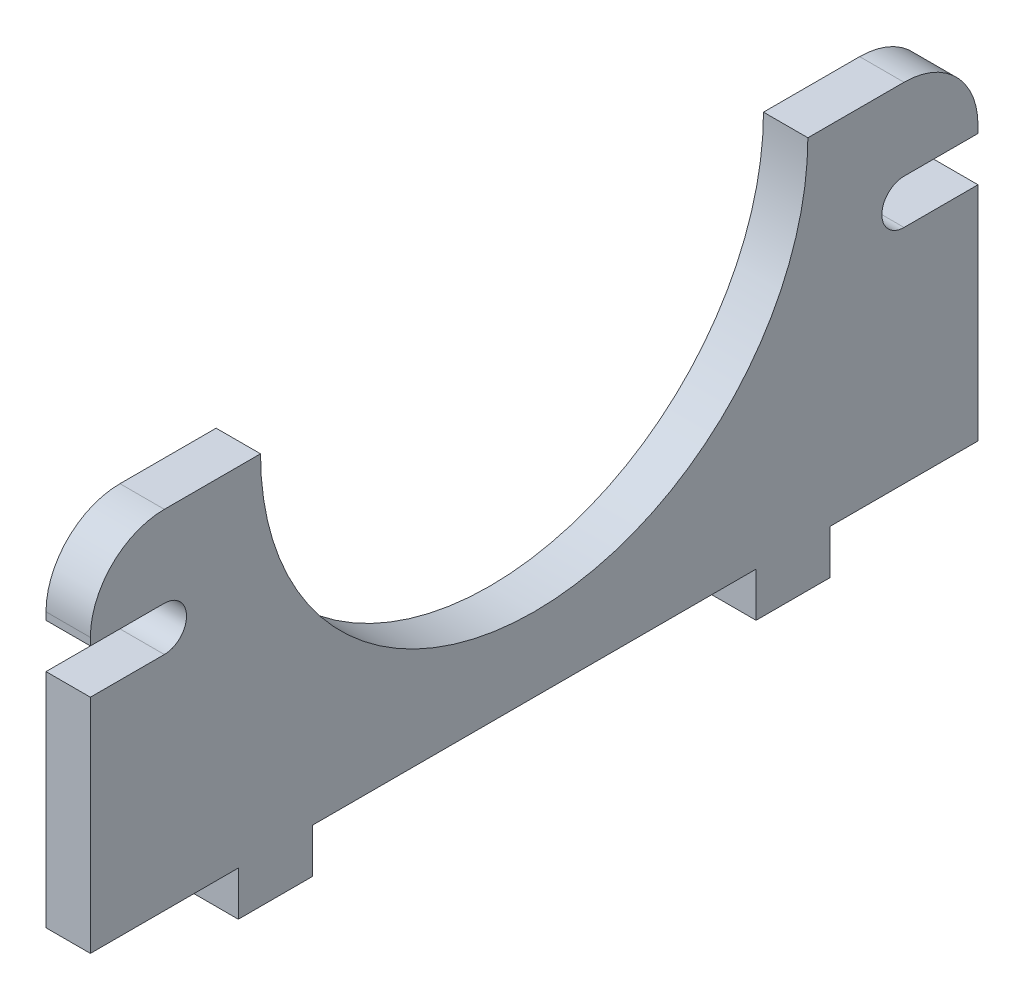
ISO-10303-21;
HEADER;
FILE_DESCRIPTION(('STEP AP214'),'2;1');
FILE_NAME('part.step','',(''),(''),'','','');
FILE_SCHEMA(('AUTOMOTIVE_DESIGN { 1 0 10303 214 1 1 1 1 }'));
ENDSEC;
DATA;
#1=APPLICATION_CONTEXT('core data for automotive mechanical design processes');
#2=APPLICATION_PROTOCOL_DEFINITION('international standard','automotive_design',2000,#1);
#3=PRODUCT_CONTEXT('',#1,'mechanical');
#4=PRODUCT('Part','Part','',(#3));
#5=PRODUCT_RELATED_PRODUCT_CATEGORY('part','',(#4));
#6=PRODUCT_DEFINITION_FORMATION('','',#4);
#7=PRODUCT_DEFINITION_CONTEXT('part definition',#1,'design');
#8=PRODUCT_DEFINITION('design','',#6,#7);
#9=PRODUCT_DEFINITION_SHAPE('','',#8);
#10=(LENGTH_UNIT() NAMED_UNIT(*) SI_UNIT(.MILLI.,.METRE.));
#11=(NAMED_UNIT(*) PLANE_ANGLE_UNIT() SI_UNIT($,.RADIAN.));
#12=(NAMED_UNIT(*) SI_UNIT($,.STERADIAN.) SOLID_ANGLE_UNIT());
#13=UNCERTAINTY_MEASURE_WITH_UNIT(LENGTH_MEASURE(1.E-05),#10,'distance_accuracy_value','');
#14=(GEOMETRIC_REPRESENTATION_CONTEXT(3) GLOBAL_UNCERTAINTY_ASSIGNED_CONTEXT((#13)) GLOBAL_UNIT_ASSIGNED_CONTEXT((#10,
#11,#12)) REPRESENTATION_CONTEXT('',''));
#15=CARTESIAN_POINT('',(0.,0.,0.));
#16=DIRECTION('',(0.,0.,1.));
#17=DIRECTION('',(1.,0.,0.));
#18=AXIS2_PLACEMENT_3D('',#15,#16,#17);
#19=CARTESIAN_POINT('',(3.,-11.75,-30.));
#20=DIRECTION('',(0.,1.,0.));
#21=DIRECTION('',(0.,0.,1.));
#22=AXIS2_PLACEMENT_3D('',#19,#20,#21);
#23=PLANE('',#22);
#24=DIRECTION('',(0.,0.,-1.));
#25=VECTOR('',#24,1.);
#26=CARTESIAN_POINT('',(3.,-11.75,-30.));
#27=LINE('',#26,#25);
#28=CARTESIAN_POINT('',(3.,-11.75,15.));
#29=VERTEX_POINT('',#28);
#30=CARTESIAN_POINT('',(3.,-11.75,-15.));
#31=VERTEX_POINT('',#30);
#32=EDGE_CURVE('E54',#29,#31,#27,.T.);
#33=ORIENTED_EDGE('',*,*,#32,.F.);
#34=DIRECTION('',(-1.,0.,0.));
#35=VECTOR('',#34,1.);
#36=CARTESIAN_POINT('',(0.,-11.75,15.));
#37=LINE('',#36,#35);
#38=CARTESIAN_POINT('',(0.,-11.75,15.));
#39=VERTEX_POINT('',#38);
#40=EDGE_CURVE('E232',#29,#39,#37,.T.);
#41=ORIENTED_EDGE('',*,*,#40,.T.);
#42=DIRECTION('',(0.,0.,-1.));
#43=VECTOR('',#42,1.);
#44=CARTESIAN_POINT('',(0.,-11.75,-30.));
#45=LINE('',#44,#43);
#46=CARTESIAN_POINT('',(0.,-11.75,-15.));
#47=VERTEX_POINT('',#46);
#48=EDGE_CURVE('E209',#39,#47,#45,.T.);
#49=ORIENTED_EDGE('',*,*,#48,.T.);
#50=DIRECTION('',(-1.,0.,0.));
#51=VECTOR('',#50,1.);
#52=CARTESIAN_POINT('',(0.,-11.75,-15.));
#53=LINE('',#52,#51);
#54=EDGE_CURVE('E244',#31,#47,#53,.T.);
#55=ORIENTED_EDGE('',*,*,#54,.F.);
#56=EDGE_LOOP('',(#33,#41,#49,#55));
#57=FACE_BOUND('',#56,.T.);
#58=ADVANCED_FACE('F39',(#57),#23,.F.);
#59=CARTESIAN_POINT('',(0.,-11.75,30.));
#60=VERTEX_POINT('',#59);
#61=CARTESIAN_POINT('',(0.,-11.75,20.));
#62=VERTEX_POINT('',#61);
#63=EDGE_CURVE('E339',#60,#62,#45,.T.);
#64=ORIENTED_EDGE('',*,*,#63,.T.);
#65=DIRECTION('',(1.,0.,0.));
#66=VECTOR('',#65,1.);
#67=CARTESIAN_POINT('',(0.,-11.75,20.));
#68=LINE('',#67,#66);
#69=CARTESIAN_POINT('',(3.,-11.75,20.));
#70=VERTEX_POINT('',#69);
#71=EDGE_CURVE('E62',#62,#70,#68,.T.);
#72=ORIENTED_EDGE('',*,*,#71,.T.);
#73=CARTESIAN_POINT('',(3.,-11.75,30.));
#74=VERTEX_POINT('',#73);
#75=EDGE_CURVE('E322',#74,#70,#27,.T.);
#76=ORIENTED_EDGE('',*,*,#75,.F.);
#77=DIRECTION('',(-1.,0.,0.));
#78=VECTOR('',#77,1.);
#79=CARTESIAN_POINT('',(3.,-11.75,30.));
#80=LINE('',#79,#78);
#81=EDGE_CURVE('E360',#74,#60,#80,.T.);
#82=ORIENTED_EDGE('',*,*,#81,.T.);
#83=EDGE_LOOP('',(#64,#72,#76,#82));
#84=FACE_BOUND('',#83,.T.);
#85=ADVANCED_FACE('F424',(#84),#23,.F.);
#86=DIRECTION('',(1.,0.,0.));
#87=VECTOR('',#86,1.);
#88=CARTESIAN_POINT('',(0.,-11.75,-20.));
#89=LINE('',#88,#87);
#90=CARTESIAN_POINT('',(0.,-11.75,-20.));
#91=VERTEX_POINT('',#90);
#92=CARTESIAN_POINT('',(3.,-11.75,-20.));
#93=VERTEX_POINT('',#92);
#94=EDGE_CURVE('E213',#91,#93,#89,.T.);
#95=ORIENTED_EDGE('',*,*,#94,.F.);
#96=CARTESIAN_POINT('',(0.,-11.75,-30.));
#97=VERTEX_POINT('',#96);
#98=EDGE_CURVE('E338',#91,#97,#45,.T.);
#99=ORIENTED_EDGE('',*,*,#98,.T.);
#100=DIRECTION('',(-1.,0.,0.));
#101=VECTOR('',#100,1.);
#102=CARTESIAN_POINT('',(3.,-11.75,-30.));
#103=LINE('',#102,#101);
#104=CARTESIAN_POINT('',(3.,-11.75,-30.));
#105=VERTEX_POINT('',#104);
#106=EDGE_CURVE('E357',#105,#97,#103,.T.);
#107=ORIENTED_EDGE('',*,*,#106,.F.);
#108=EDGE_CURVE('E320',#93,#105,#27,.T.);
#109=ORIENTED_EDGE('',*,*,#108,.F.);
#110=EDGE_LOOP('',(#95,#99,#107,#109));
#111=FACE_BOUND('',#110,.T.);
#112=ADVANCED_FACE('F438',(#111),#23,.F.);
#113=CARTESIAN_POINT('',(3.,-11.75,-30.));
#114=DIRECTION('',(0.,0.,1.));
#115=DIRECTION('',(1.,0.,0.));
#116=AXIS2_PLACEMENT_3D('',#113,#114,#115);
#117=PLANE('',#116);
#118=DIRECTION('',(0.,1.,0.));
#119=VECTOR('',#118,1.);
#120=CARTESIAN_POINT('',(0.,-11.75,-30.));
#121=LINE('',#120,#119);
#122=CARTESIAN_POINT('',(0.,6.25,-30.));
#123=VERTEX_POINT('',#122);
#124=CARTESIAN_POINT('',(0.,6.75,-30.));
#125=VERTEX_POINT('',#124);
#126=EDGE_CURVE('E341',#123,#125,#121,.T.);
#127=ORIENTED_EDGE('',*,*,#126,.T.);
#128=DIRECTION('',(-1.,0.,0.));
#129=VECTOR('',#128,1.);
#130=CARTESIAN_POINT('',(3.,6.75,-30.));
#131=LINE('',#130,#129);
#132=CARTESIAN_POINT('',(3.,6.75,-30.));
#133=VERTEX_POINT('',#132);
#134=EDGE_CURVE('E11',#125,#133,#131,.F.);
#135=ORIENTED_EDGE('',*,*,#134,.T.);
#136=DIRECTION('',(0.,1.,0.));
#137=VECTOR('',#136,1.);
#138=CARTESIAN_POINT('',(3.,-11.75,-30.));
#139=LINE('',#138,#137);
#140=CARTESIAN_POINT('',(3.,6.25,-30.));
#141=VERTEX_POINT('',#140);
#142=EDGE_CURVE('E324',#141,#133,#139,.T.);
#143=ORIENTED_EDGE('',*,*,#142,.F.);
#144=DIRECTION('',(1.,0.,0.));
#145=VECTOR('',#144,1.);
#146=CARTESIAN_POINT('',(0.,6.25,-30.));
#147=LINE('',#146,#145);
#148=EDGE_CURVE('E285',#123,#141,#147,.T.);
#149=ORIENTED_EDGE('',*,*,#148,.F.);
#150=EDGE_LOOP('',(#127,#135,#143,#149));
#151=FACE_BOUND('',#150,.T.);
#152=ADVANCED_FACE('F445',(#151),#117,.F.);
#153=DIRECTION('',(1.,0.,0.));
#154=VECTOR('',#153,1.);
#155=CARTESIAN_POINT('',(0.,3.25,-30.));
#156=LINE('',#155,#154);
#157=CARTESIAN_POINT('',(0.,3.25,-30.));
#158=VERTEX_POINT('',#157);
#159=CARTESIAN_POINT('',(3.,3.25,-30.));
#160=VERTEX_POINT('',#159);
#161=EDGE_CURVE('E287',#158,#160,#156,.T.);
#162=ORIENTED_EDGE('',*,*,#161,.T.);
#163=EDGE_CURVE('E325',#105,#160,#139,.T.);
#164=ORIENTED_EDGE('',*,*,#163,.F.);
#165=ORIENTED_EDGE('',*,*,#106,.T.);
#166=EDGE_CURVE('E342',#97,#158,#121,.T.);
#167=ORIENTED_EDGE('',*,*,#166,.T.);
#168=EDGE_LOOP('',(#162,#164,#165,#167));
#169=FACE_BOUND('',#168,.T.);
#170=ADVANCED_FACE('F450',(#169),#117,.F.);
#171=CARTESIAN_POINT('',(3.,11.75,0.));
#172=DIRECTION('',(1.,0.,0.));
#173=DIRECTION('',(0.,0.,-1.));
#174=AXIS2_PLACEMENT_3D('',#171,#172,#173);
#175=PLANE('',#174);
#176=DIRECTION('',(0.,0.,1.));
#177=VECTOR('',#176,1.);
#178=CARTESIAN_POINT('',(3.,11.75,18.5));
#179=LINE('',#178,#177);
#180=CARTESIAN_POINT('',(3.,11.75,18.5));
#181=VERTEX_POINT('',#180);
#182=CARTESIAN_POINT('',(3.,11.75,25.));
#183=VERTEX_POINT('',#182);
#184=EDGE_CURVE('E332',#181,#183,#179,.T.);
#185=ORIENTED_EDGE('',*,*,#184,.T.);
#186=CARTESIAN_POINT('',(3.,6.75,25.));
#187=DIRECTION('',(1.,0.,0.));
#188=DIRECTION('',(0.,0.,-1.));
#189=AXIS2_PLACEMENT_3D('',#186,#187,#188);
#190=CIRCLE('',#189,5.);
#191=CARTESIAN_POINT('',(3.,6.75,30.));
#192=VERTEX_POINT('',#191);
#193=EDGE_CURVE('E374',#183,#192,#190,.T.);
#194=ORIENTED_EDGE('',*,*,#193,.T.);
#195=DIRECTION('',(0.,-1.,0.));
#196=VECTOR('',#195,1.);
#197=CARTESIAN_POINT('',(3.,-11.75,30.));
#198=LINE('',#197,#196);
#199=CARTESIAN_POINT('',(3.,6.25,30.));
#200=VERTEX_POINT('',#199);
#201=EDGE_CURVE('E318',#192,#200,#198,.T.);
#202=ORIENTED_EDGE('',*,*,#201,.T.);
#203=DIRECTION('',(0.,0.,1.));
#204=VECTOR('',#203,1.);
#205=CARTESIAN_POINT('',(3.,6.25,25.));
#206=LINE('',#205,#204);
#207=CARTESIAN_POINT('',(3.,6.25,25.));
#208=VERTEX_POINT('',#207);
#209=EDGE_CURVE('E304',#208,#200,#206,.T.);
#210=ORIENTED_EDGE('',*,*,#209,.F.);
#211=CARTESIAN_POINT('',(3.,4.75,25.));
#212=DIRECTION('',(1.,0.,0.));
#213=DIRECTION('',(0.,0.,-1.));
#214=AXIS2_PLACEMENT_3D('',#211,#212,#213);
#215=CIRCLE('',#214,1.5);
#216=CARTESIAN_POINT('',(3.,3.25,25.));
#217=VERTEX_POINT('',#216);
#218=EDGE_CURVE('E284',#217,#208,#215,.T.);
#219=ORIENTED_EDGE('',*,*,#218,.F.);
#220=DIRECTION('',(0.,0.,-1.));
#221=VECTOR('',#220,1.);
#222=CARTESIAN_POINT('',(3.,3.25,25.));
#223=LINE('',#222,#221);
#224=CARTESIAN_POINT('',(3.,3.25,30.));
#225=VERTEX_POINT('',#224);
#226=EDGE_CURVE('E295',#225,#217,#223,.T.);
#227=ORIENTED_EDGE('',*,*,#226,.F.);
#228=EDGE_CURVE('E321',#225,#74,#198,.T.);
#229=ORIENTED_EDGE('',*,*,#228,.T.);
#230=ORIENTED_EDGE('',*,*,#75,.T.);
#231=DIRECTION('',(0.,1.,0.));
#232=VECTOR('',#231,1.);
#233=CARTESIAN_POINT('',(3.,-14.75,20.));
#234=LINE('',#233,#232);
#235=CARTESIAN_POINT('',(3.,-14.75,20.));
#236=VERTEX_POINT('',#235);
#237=EDGE_CURVE('E236',#236,#70,#234,.T.);
#238=ORIENTED_EDGE('',*,*,#237,.F.);
#239=DIRECTION('',(0.,0.,-1.));
#240=VECTOR('',#239,1.);
#241=CARTESIAN_POINT('',(3.,-14.75,20.));
#242=LINE('',#241,#240);
#243=CARTESIAN_POINT('',(3.,-14.75,15.));
#244=VERTEX_POINT('',#243);
#245=EDGE_CURVE('E226',#236,#244,#242,.T.);
#246=ORIENTED_EDGE('',*,*,#245,.T.);
#247=DIRECTION('',(0.,1.,0.));
#248=VECTOR('',#247,1.);
#249=CARTESIAN_POINT('',(3.,-14.75,15.));
#250=LINE('',#249,#248);
#251=EDGE_CURVE('E214',#244,#29,#250,.T.);
#252=ORIENTED_EDGE('',*,*,#251,.T.);
#253=ORIENTED_EDGE('',*,*,#32,.T.);
#254=DIRECTION('',(0.,1.,0.));
#255=VECTOR('',#254,1.);
#256=CARTESIAN_POINT('',(3.,-14.75,-15.));
#257=LINE('',#256,#255);
#258=CARTESIAN_POINT('',(3.,-14.75,-15.));
#259=VERTEX_POINT('',#258);
#260=EDGE_CURVE('E256',#259,#31,#257,.T.);
#261=ORIENTED_EDGE('',*,*,#260,.F.);
#262=DIRECTION('',(0.,0.,1.));
#263=VECTOR('',#262,1.);
#264=CARTESIAN_POINT('',(3.,-14.75,-20.));
#265=LINE('',#264,#263);
#266=CARTESIAN_POINT('',(3.,-14.75,-20.));
#267=VERTEX_POINT('',#266);
#268=EDGE_CURVE('E246',#267,#259,#265,.T.);
#269=ORIENTED_EDGE('',*,*,#268,.F.);
#270=DIRECTION('',(0.,1.,0.));
#271=VECTOR('',#270,1.);
#272=CARTESIAN_POINT('',(3.,-14.75,-20.));
#273=LINE('',#272,#271);
#274=EDGE_CURVE('E259',#267,#93,#273,.T.);
#275=ORIENTED_EDGE('',*,*,#274,.T.);
#276=ORIENTED_EDGE('',*,*,#108,.T.);
#277=ORIENTED_EDGE('',*,*,#163,.T.);
#278=DIRECTION('',(0.,0.,1.));
#279=VECTOR('',#278,1.);
#280=CARTESIAN_POINT('',(3.,3.25,-25.));
#281=LINE('',#280,#279);
#282=CARTESIAN_POINT('',(3.,3.25,-25.));
#283=VERTEX_POINT('',#282);
#284=EDGE_CURVE('E276',#160,#283,#281,.T.);
#285=ORIENTED_EDGE('',*,*,#284,.T.);
#286=CARTESIAN_POINT('',(3.,4.75,-25.));
#287=DIRECTION('',(-1.,0.,0.));
#288=DIRECTION('',(0.,0.,1.));
#289=AXIS2_PLACEMENT_3D('',#286,#287,#288);
#290=CIRCLE('',#289,1.5);
#291=CARTESIAN_POINT('',(3.,6.25,-25.));
#292=VERTEX_POINT('',#291);
#293=EDGE_CURVE('E265',#283,#292,#290,.T.);
#294=ORIENTED_EDGE('',*,*,#293,.T.);
#295=DIRECTION('',(0.,0.,-1.));
#296=VECTOR('',#295,1.);
#297=CARTESIAN_POINT('',(3.,6.25,-25.));
#298=LINE('',#297,#296);
#299=EDGE_CURVE('E269',#292,#141,#298,.T.);
#300=ORIENTED_EDGE('',*,*,#299,.T.);
#301=ORIENTED_EDGE('',*,*,#142,.T.);
#302=CARTESIAN_POINT('',(3.,6.75,-25.));
#303=DIRECTION('',(1.,0.,0.));
#304=DIRECTION('',(0.,0.,-1.));
#305=AXIS2_PLACEMENT_3D('',#302,#303,#304);
#306=CIRCLE('',#305,5.);
#307=CARTESIAN_POINT('',(3.,11.75,-25.));
#308=VERTEX_POINT('',#307);
#309=EDGE_CURVE('E372',#133,#308,#306,.T.);
#310=ORIENTED_EDGE('',*,*,#309,.T.);
#311=DIRECTION('',(0.,0.,1.));
#312=VECTOR('',#311,1.);
#313=CARTESIAN_POINT('',(3.,11.75,-30.));
#314=LINE('',#313,#312);
#315=CARTESIAN_POINT('',(3.,11.75,-18.5));
#316=VERTEX_POINT('',#315);
#317=EDGE_CURVE('E328',#308,#316,#314,.T.);
#318=ORIENTED_EDGE('',*,*,#317,.T.);
#319=CARTESIAN_POINT('',(3.,11.75,0.));
#320=DIRECTION('',(-1.,0.,0.));
#321=DIRECTION('',(0.,0.,-1.));
#322=AXIS2_PLACEMENT_3D('',#319,#320,#321);
#323=CIRCLE('',#322,18.5);
#324=EDGE_CURVE('E330',#316,#181,#323,.T.);
#325=ORIENTED_EDGE('',*,*,#324,.T.);
#326=EDGE_LOOP('',(#185,#194,#202,#210,#219,#227,#229,#230,#238,#246,#252,#253,#261,#269,#275,
#276,#277,#285,#294,#300,#301,#310,#318,#325));
#327=FACE_BOUND('',#326,.T.);
#328=ADVANCED_FACE('F398',(#327),#175,.T.);
#329=CARTESIAN_POINT('',(0.,11.75,0.));
#330=DIRECTION('',(1.,0.,0.));
#331=DIRECTION('',(0.,0.,-1.));
#332=AXIS2_PLACEMENT_3D('',#329,#330,#331);
#333=PLANE('',#332);
#334=DIRECTION('',(0.,-1.,0.));
#335=VECTOR('',#334,1.);
#336=CARTESIAN_POINT('',(0.,-11.75,30.));
#337=LINE('',#336,#335);
#338=CARTESIAN_POINT('',(0.,6.75,30.));
#339=VERTEX_POINT('',#338);
#340=CARTESIAN_POINT('',(0.,6.25,30.));
#341=VERTEX_POINT('',#340);
#342=EDGE_CURVE('E336',#339,#341,#337,.T.);
#343=ORIENTED_EDGE('',*,*,#342,.F.);
#344=CARTESIAN_POINT('',(0.,6.75,25.));
#345=DIRECTION('',(1.,0.,0.));
#346=DIRECTION('',(0.,0.,-1.));
#347=AXIS2_PLACEMENT_3D('',#344,#345,#346);
#348=CIRCLE('',#347,5.);
#349=CARTESIAN_POINT('',(0.,11.75,25.));
#350=VERTEX_POINT('',#349);
#351=EDGE_CURVE('E368',#339,#350,#348,.F.);
#352=ORIENTED_EDGE('',*,*,#351,.T.);
#353=DIRECTION('',(0.,0.,1.));
#354=VECTOR('',#353,1.);
#355=CARTESIAN_POINT('',(0.,11.75,18.5));
#356=LINE('',#355,#354);
#357=CARTESIAN_POINT('',(0.,11.75,18.5));
#358=VERTEX_POINT('',#357);
#359=EDGE_CURVE('E349',#358,#350,#356,.T.);
#360=ORIENTED_EDGE('',*,*,#359,.F.);
#361=CARTESIAN_POINT('',(0.,11.75,0.));
#362=DIRECTION('',(-1.,0.,0.));
#363=DIRECTION('',(0.,0.,-1.));
#364=AXIS2_PLACEMENT_3D('',#361,#362,#363);
#365=CIRCLE('',#364,18.5);
#366=CARTESIAN_POINT('',(0.,11.75,-18.5));
#367=VERTEX_POINT('',#366);
#368=EDGE_CURVE('E347',#367,#358,#365,.T.);
#369=ORIENTED_EDGE('',*,*,#368,.F.);
#370=DIRECTION('',(0.,0.,1.));
#371=VECTOR('',#370,1.);
#372=CARTESIAN_POINT('',(0.,11.75,-30.));
#373=LINE('',#372,#371);
#374=CARTESIAN_POINT('',(0.,11.75,-25.));
#375=VERTEX_POINT('',#374);
#376=EDGE_CURVE('E345',#375,#367,#373,.T.);
#377=ORIENTED_EDGE('',*,*,#376,.F.);
#378=CARTESIAN_POINT('',(0.,6.75,-25.));
#379=DIRECTION('',(1.,0.,0.));
#380=DIRECTION('',(0.,0.,-1.));
#381=AXIS2_PLACEMENT_3D('',#378,#379,#380);
#382=CIRCLE('',#381,5.);
#383=EDGE_CURVE('E366',#375,#125,#382,.F.);
#384=ORIENTED_EDGE('',*,*,#383,.T.);
#385=ORIENTED_EDGE('',*,*,#126,.F.);
#386=DIRECTION('',(0.,0.,-1.));
#387=VECTOR('',#386,1.);
#388=CARTESIAN_POINT('',(0.,6.25,-25.));
#389=LINE('',#388,#387);
#390=CARTESIAN_POINT('',(0.,6.25,-25.));
#391=VERTEX_POINT('',#390);
#392=EDGE_CURVE('E271',#391,#123,#389,.T.);
#393=ORIENTED_EDGE('',*,*,#392,.F.);
#394=CARTESIAN_POINT('',(0.,4.75,-25.));
#395=DIRECTION('',(-1.,0.,0.));
#396=DIRECTION('',(0.,0.,1.));
#397=AXIS2_PLACEMENT_3D('',#394,#395,#396);
#398=CIRCLE('',#397,1.5);
#399=CARTESIAN_POINT('',(0.,3.25,-25.));
#400=VERTEX_POINT('',#399);
#401=EDGE_CURVE('E266',#400,#391,#398,.T.);
#402=ORIENTED_EDGE('',*,*,#401,.F.);
#403=DIRECTION('',(0.,0.,1.));
#404=VECTOR('',#403,1.);
#405=CARTESIAN_POINT('',(0.,3.25,-25.));
#406=LINE('',#405,#404);
#407=EDGE_CURVE('E268',#158,#400,#406,.T.);
#408=ORIENTED_EDGE('',*,*,#407,.F.);
#409=ORIENTED_EDGE('',*,*,#166,.F.);
#410=ORIENTED_EDGE('',*,*,#98,.F.);
#411=DIRECTION('',(0.,1.,0.));
#412=VECTOR('',#411,1.);
#413=CARTESIAN_POINT('',(0.,-14.75,-20.));
#414=LINE('',#413,#412);
#415=CARTESIAN_POINT('',(0.,-14.75,-20.));
#416=VERTEX_POINT('',#415);
#417=EDGE_CURVE('E262',#416,#91,#414,.T.);
#418=ORIENTED_EDGE('',*,*,#417,.F.);
#419=DIRECTION('',(0.,0.,-1.));
#420=VECTOR('',#419,1.);
#421=CARTESIAN_POINT('',(0.,-14.75,-20.));
#422=LINE('',#421,#420);
#423=CARTESIAN_POINT('',(0.,-14.75,-15.));
#424=VERTEX_POINT('',#423);
#425=EDGE_CURVE('E240',#424,#416,#422,.T.);
#426=ORIENTED_EDGE('',*,*,#425,.F.);
#427=DIRECTION('',(0.,1.,0.));
#428=VECTOR('',#427,1.);
#429=CARTESIAN_POINT('',(0.,-14.75,-15.));
#430=LINE('',#429,#428);
#431=EDGE_CURVE('E250',#424,#47,#430,.T.);
#432=ORIENTED_EDGE('',*,*,#431,.T.);
#433=ORIENTED_EDGE('',*,*,#48,.F.);
#434=DIRECTION('',(0.,1.,0.));
#435=VECTOR('',#434,1.);
#436=CARTESIAN_POINT('',(0.,-14.75,15.));
#437=LINE('',#436,#435);
#438=CARTESIAN_POINT('',(0.,-14.75,15.));
#439=VERTEX_POINT('',#438);
#440=EDGE_CURVE('E201',#439,#39,#437,.T.);
#441=ORIENTED_EDGE('',*,*,#440,.F.);
#442=DIRECTION('',(0.,0.,1.));
#443=VECTOR('',#442,1.);
#444=CARTESIAN_POINT('',(0.,-14.75,20.));
#445=LINE('',#444,#443);
#446=CARTESIAN_POINT('',(0.,-14.75,20.));
#447=VERTEX_POINT('',#446);
#448=EDGE_CURVE('E206',#439,#447,#445,.T.);
#449=ORIENTED_EDGE('',*,*,#448,.T.);
#450=DIRECTION('',(0.,1.,0.));
#451=VECTOR('',#450,1.);
#452=CARTESIAN_POINT('',(0.,-14.75,20.));
#453=LINE('',#452,#451);
#454=EDGE_CURVE('E231',#447,#62,#453,.T.);
#455=ORIENTED_EDGE('',*,*,#454,.T.);
#456=ORIENTED_EDGE('',*,*,#63,.F.);
#457=CARTESIAN_POINT('',(0.,3.25,30.));
#458=VERTEX_POINT('',#457);
#459=EDGE_CURVE('E311',#458,#60,#337,.T.);
#460=ORIENTED_EDGE('',*,*,#459,.F.);
#461=DIRECTION('',(0.,0.,-1.));
#462=VECTOR('',#461,1.);
#463=CARTESIAN_POINT('',(0.,3.25,25.));
#464=LINE('',#463,#462);
#465=CARTESIAN_POINT('',(0.,3.25,25.));
#466=VERTEX_POINT('',#465);
#467=EDGE_CURVE('E298',#458,#466,#464,.T.);
#468=ORIENTED_EDGE('',*,*,#467,.T.);
#469=CARTESIAN_POINT('',(0.,4.75,25.));
#470=DIRECTION('',(1.,0.,0.));
#471=DIRECTION('',(0.,0.,-1.));
#472=AXIS2_PLACEMENT_3D('',#469,#470,#471);
#473=CIRCLE('',#472,1.5);
#474=CARTESIAN_POINT('',(0.,6.25,25.));
#475=VERTEX_POINT('',#474);
#476=EDGE_CURVE('E291',#466,#475,#473,.T.);
#477=ORIENTED_EDGE('',*,*,#476,.T.);
#478=DIRECTION('',(0.,0.,1.));
#479=VECTOR('',#478,1.);
#480=CARTESIAN_POINT('',(0.,6.25,25.));
#481=LINE('',#480,#479);
#482=EDGE_CURVE('E294',#475,#341,#481,.T.);
#483=ORIENTED_EDGE('',*,*,#482,.T.);
#484=EDGE_LOOP('',(#343,#352,#360,#369,#377,#384,#385,#393,#402,#408,#409,#410,#418,#426,#432,
#433,#441,#449,#455,#456,#460,#468,#477,#483));
#485=FACE_BOUND('',#484,.T.);
#486=ADVANCED_FACE('F204',(#485),#333,.F.);
#487=CARTESIAN_POINT('',(3.,-11.75,30.));
#488=DIRECTION('',(0.,0.,-1.));
#489=DIRECTION('',(0.,1.,0.));
#490=AXIS2_PLACEMENT_3D('',#487,#488,#489);
#491=PLANE('',#490);
#492=ORIENTED_EDGE('',*,*,#228,.F.);
#493=DIRECTION('',(1.,0.,0.));
#494=VECTOR('',#493,1.);
#495=CARTESIAN_POINT('',(0.,3.25,30.));
#496=LINE('',#495,#494);
#497=EDGE_CURVE('E312',#458,#225,#496,.T.);
#498=ORIENTED_EDGE('',*,*,#497,.F.);
#499=ORIENTED_EDGE('',*,*,#459,.T.);
#500=ORIENTED_EDGE('',*,*,#81,.F.);
#501=EDGE_LOOP('',(#492,#498,#499,#500));
#502=FACE_BOUND('',#501,.T.);
#503=ADVANCED_FACE('F421',(#502),#491,.F.);
#504=ORIENTED_EDGE('',*,*,#201,.F.);
#505=DIRECTION('',(-1.,0.,0.));
#506=VECTOR('',#505,1.);
#507=CARTESIAN_POINT('',(3.,6.75,30.));
#508=LINE('',#507,#506);
#509=EDGE_CURVE('E363',#192,#339,#508,.T.);
#510=ORIENTED_EDGE('',*,*,#509,.T.);
#511=ORIENTED_EDGE('',*,*,#342,.T.);
#512=DIRECTION('',(1.,0.,0.));
#513=VECTOR('',#512,1.);
#514=CARTESIAN_POINT('',(0.,6.25,30.));
#515=LINE('',#514,#513);
#516=EDGE_CURVE('E314',#341,#200,#515,.T.);
#517=ORIENTED_EDGE('',*,*,#516,.T.);
#518=EDGE_LOOP('',(#504,#510,#511,#517));
#519=FACE_BOUND('',#518,.T.);
#520=ADVANCED_FACE('F404',(#519),#491,.F.);
#521=CARTESIAN_POINT('',(3.,11.75,-30.));
#522=DIRECTION('',(0.,-1.,0.));
#523=DIRECTION('',(0.,0.,-1.));
#524=AXIS2_PLACEMENT_3D('',#521,#522,#523);
#525=PLANE('',#524);
#526=ORIENTED_EDGE('',*,*,#317,.F.);
#527=DIRECTION('',(-1.,0.,0.));
#528=VECTOR('',#527,1.);
#529=CARTESIAN_POINT('',(3.,11.75,-25.));
#530=LINE('',#529,#528);
#531=EDGE_CURVE('E47',#308,#375,#530,.T.);
#532=ORIENTED_EDGE('',*,*,#531,.T.);
#533=ORIENTED_EDGE('',*,*,#376,.T.);
#534=DIRECTION('',(-1.,0.,0.));
#535=VECTOR('',#534,1.);
#536=CARTESIAN_POINT('',(3.,11.75,-18.5));
#537=LINE('',#536,#535);
#538=EDGE_CURVE('E354',#316,#367,#537,.T.);
#539=ORIENTED_EDGE('',*,*,#538,.F.);
#540=EDGE_LOOP('',(#526,#532,#533,#539));
#541=FACE_BOUND('',#540,.T.);
#542=ADVANCED_FACE('F380',(#541),#525,.F.);
#543=CARTESIAN_POINT('',(3.,11.75,0.));
#544=DIRECTION('',(-1.,0.,0.));
#545=DIRECTION('',(0.,0.,1.));
#546=AXIS2_PLACEMENT_3D('',#543,#544,#545);
#547=CYLINDRICAL_SURFACE('',#546,18.5);
#548=ORIENTED_EDGE('',*,*,#368,.T.);
#549=DIRECTION('',(-1.,0.,0.));
#550=VECTOR('',#549,1.);
#551=CARTESIAN_POINT('',(3.,11.75,18.5));
#552=LINE('',#551,#550);
#553=EDGE_CURVE('E335',#181,#358,#552,.T.);
#554=ORIENTED_EDGE('',*,*,#553,.F.);
#555=ORIENTED_EDGE('',*,*,#324,.F.);
#556=ORIENTED_EDGE('',*,*,#538,.T.);
#557=EDGE_LOOP('',(#548,#554,#555,#556));
#558=FACE_BOUND('',#557,.T.);
#559=ADVANCED_FACE('F390',(#558),#547,.F.);
#560=CARTESIAN_POINT('',(3.,11.75,18.5));
#561=DIRECTION('',(0.,-1.,0.));
#562=DIRECTION('',(0.,0.,-1.));
#563=AXIS2_PLACEMENT_3D('',#560,#561,#562);
#564=PLANE('',#563);
#565=ORIENTED_EDGE('',*,*,#359,.T.);
#566=DIRECTION('',(-1.,0.,0.));
#567=VECTOR('',#566,1.);
#568=CARTESIAN_POINT('',(3.,11.75,25.));
#569=LINE('',#568,#567);
#570=EDGE_CURVE('E370',#350,#183,#569,.F.);
#571=ORIENTED_EDGE('',*,*,#570,.T.);
#572=ORIENTED_EDGE('',*,*,#184,.F.);
#573=ORIENTED_EDGE('',*,*,#553,.T.);
#574=EDGE_LOOP('',(#565,#571,#572,#573));
#575=FACE_BOUND('',#574,.T.);
#576=ADVANCED_FACE('F394',(#575),#564,.F.);
#577=CARTESIAN_POINT('',(0.,4.75,25.));
#578=DIRECTION('',(1.,0.,0.));
#579=DIRECTION('',(0.,0.,-1.));
#580=AXIS2_PLACEMENT_3D('',#577,#578,#579);
#581=CYLINDRICAL_SURFACE('',#580,1.5);
#582=ORIENTED_EDGE('',*,*,#218,.T.);
#583=DIRECTION('',(1.,0.,0.));
#584=VECTOR('',#583,1.);
#585=CARTESIAN_POINT('',(0.,6.25,25.));
#586=LINE('',#585,#584);
#587=EDGE_CURVE('E301',#475,#208,#586,.T.);
#588=ORIENTED_EDGE('',*,*,#587,.F.);
#589=ORIENTED_EDGE('',*,*,#476,.F.);
#590=DIRECTION('',(1.,0.,0.));
#591=VECTOR('',#590,1.);
#592=CARTESIAN_POINT('',(0.,3.25,25.));
#593=LINE('',#592,#591);
#594=EDGE_CURVE('E309',#466,#217,#593,.T.);
#595=ORIENTED_EDGE('',*,*,#594,.T.);
#596=EDGE_LOOP('',(#582,#588,#589,#595));
#597=FACE_BOUND('',#596,.T.);
#598=ADVANCED_FACE('F415',(#597),#581,.F.);
#599=CARTESIAN_POINT('',(0.,3.25,25.));
#600=DIRECTION('',(0.,-1.,0.));
#601=DIRECTION('',(0.,0.,-1.));
#602=AXIS2_PLACEMENT_3D('',#599,#600,#601);
#603=PLANE('',#602);
#604=ORIENTED_EDGE('',*,*,#226,.T.);
#605=ORIENTED_EDGE('',*,*,#594,.F.);
#606=ORIENTED_EDGE('',*,*,#467,.F.);
#607=ORIENTED_EDGE('',*,*,#497,.T.);
#608=EDGE_LOOP('',(#604,#605,#606,#607));
#609=FACE_BOUND('',#608,.T.);
#610=ADVANCED_FACE('F417',(#609),#603,.F.);
#611=CARTESIAN_POINT('',(0.,6.25,25.));
#612=DIRECTION('',(0.,1.,0.));
#613=DIRECTION('',(0.,0.,1.));
#614=AXIS2_PLACEMENT_3D('',#611,#612,#613);
#615=PLANE('',#614);
#616=ORIENTED_EDGE('',*,*,#209,.T.);
#617=ORIENTED_EDGE('',*,*,#516,.F.);
#618=ORIENTED_EDGE('',*,*,#482,.F.);
#619=ORIENTED_EDGE('',*,*,#587,.T.);
#620=EDGE_LOOP('',(#616,#617,#618,#619));
#621=FACE_BOUND('',#620,.T.);
#622=ADVANCED_FACE('F409',(#621),#615,.F.);
#623=CARTESIAN_POINT('',(0.,4.75,-25.));
#624=DIRECTION('',(1.,0.,0.));
#625=DIRECTION('',(0.,0.,-1.));
#626=AXIS2_PLACEMENT_3D('',#623,#624,#625);
#627=CYLINDRICAL_SURFACE('',#626,1.5);
#628=ORIENTED_EDGE('',*,*,#293,.F.);
#629=DIRECTION('',(1.,0.,0.));
#630=VECTOR('',#629,1.);
#631=CARTESIAN_POINT('',(0.,3.25,-25.));
#632=LINE('',#631,#630);
#633=EDGE_CURVE('E273',#400,#283,#632,.T.);
#634=ORIENTED_EDGE('',*,*,#633,.F.);
#635=ORIENTED_EDGE('',*,*,#401,.T.);
#636=DIRECTION('',(1.,0.,0.));
#637=VECTOR('',#636,1.);
#638=CARTESIAN_POINT('',(0.,6.25,-25.));
#639=LINE('',#638,#637);
#640=EDGE_CURVE('E281',#391,#292,#639,.T.);
#641=ORIENTED_EDGE('',*,*,#640,.T.);
#642=EDGE_LOOP('',(#628,#634,#635,#641));
#643=FACE_BOUND('',#642,.T.);
#644=ADVANCED_FACE('F478',(#643),#627,.F.);
#645=CARTESIAN_POINT('',(0.,6.25,-25.));
#646=DIRECTION('',(0.,-1.,0.));
#647=DIRECTION('',(0.,0.,-1.));
#648=AXIS2_PLACEMENT_3D('',#645,#646,#647);
#649=PLANE('',#648);
#650=ORIENTED_EDGE('',*,*,#299,.F.);
#651=ORIENTED_EDGE('',*,*,#640,.F.);
#652=ORIENTED_EDGE('',*,*,#392,.T.);
#653=ORIENTED_EDGE('',*,*,#148,.T.);
#654=EDGE_LOOP('',(#650,#651,#652,#653));
#655=FACE_BOUND('',#654,.T.);
#656=ADVANCED_FACE('F480',(#655),#649,.T.);
#657=CARTESIAN_POINT('',(0.,3.25,-25.));
#658=DIRECTION('',(0.,1.,0.));
#659=DIRECTION('',(0.,0.,1.));
#660=AXIS2_PLACEMENT_3D('',#657,#658,#659);
#661=PLANE('',#660);
#662=ORIENTED_EDGE('',*,*,#284,.F.);
#663=ORIENTED_EDGE('',*,*,#161,.F.);
#664=ORIENTED_EDGE('',*,*,#407,.T.);
#665=ORIENTED_EDGE('',*,*,#633,.T.);
#666=EDGE_LOOP('',(#662,#663,#664,#665));
#667=FACE_BOUND('',#666,.T.);
#668=ADVANCED_FACE('F471',(#667),#661,.T.);
#669=CARTESIAN_POINT('',(3.,6.75,25.));
#670=DIRECTION('',(-1.,0.,0.));
#671=DIRECTION('',(0.,0.,1.));
#672=AXIS2_PLACEMENT_3D('',#669,#670,#671);
#673=CYLINDRICAL_SURFACE('',#672,5.);
#674=ORIENTED_EDGE('',*,*,#193,.F.);
#675=ORIENTED_EDGE('',*,*,#570,.F.);
#676=ORIENTED_EDGE('',*,*,#351,.F.);
#677=ORIENTED_EDGE('',*,*,#509,.F.);
#678=EDGE_LOOP('',(#674,#675,#676,#677));
#679=FACE_BOUND('',#678,.T.);
#680=ADVANCED_FACE('F402',(#679),#673,.T.);
#681=CARTESIAN_POINT('',(3.,6.75,-25.));
#682=DIRECTION('',(-1.,0.,0.));
#683=DIRECTION('',(0.,0.,1.));
#684=AXIS2_PLACEMENT_3D('',#681,#682,#683);
#685=CYLINDRICAL_SURFACE('',#684,5.);
#686=ORIENTED_EDGE('',*,*,#309,.F.);
#687=ORIENTED_EDGE('',*,*,#134,.F.);
#688=ORIENTED_EDGE('',*,*,#383,.F.);
#689=ORIENTED_EDGE('',*,*,#531,.F.);
#690=EDGE_LOOP('',(#686,#687,#688,#689));
#691=FACE_BOUND('',#690,.T.);
#692=ADVANCED_FACE('F41',(#691),#685,.T.);
#693=CARTESIAN_POINT('',(0.,-14.75,-20.));
#694=DIRECTION('',(0.,0.,1.));
#695=DIRECTION('',(0.,-1.,0.));
#696=AXIS2_PLACEMENT_3D('',#693,#694,#695);
#697=PLANE('',#696);
#698=ORIENTED_EDGE('',*,*,#94,.T.);
#699=ORIENTED_EDGE('',*,*,#274,.F.);
#700=DIRECTION('',(1.,0.,0.));
#701=VECTOR('',#700,1.);
#702=CARTESIAN_POINT('',(0.,-14.75,-20.));
#703=LINE('',#702,#701);
#704=EDGE_CURVE('E243',#416,#267,#703,.T.);
#705=ORIENTED_EDGE('',*,*,#704,.F.);
#706=ORIENTED_EDGE('',*,*,#417,.T.);
#707=EDGE_LOOP('',(#698,#699,#705,#706));
#708=FACE_BOUND('',#707,.T.);
#709=ADVANCED_FACE('F460',(#708),#697,.F.);
#710=CARTESIAN_POINT('',(0.,-14.75,-15.));
#711=DIRECTION('',(0.,0.,-1.));
#712=DIRECTION('',(0.,1.,0.));
#713=AXIS2_PLACEMENT_3D('',#710,#711,#712);
#714=PLANE('',#713);
#715=ORIENTED_EDGE('',*,*,#54,.T.);
#716=ORIENTED_EDGE('',*,*,#431,.F.);
#717=DIRECTION('',(-1.,0.,0.));
#718=VECTOR('',#717,1.);
#719=CARTESIAN_POINT('',(0.,-14.75,-15.));
#720=LINE('',#719,#718);
#721=EDGE_CURVE('E248',#259,#424,#720,.T.);
#722=ORIENTED_EDGE('',*,*,#721,.F.);
#723=ORIENTED_EDGE('',*,*,#260,.T.);
#724=EDGE_LOOP('',(#715,#716,#722,#723));
#725=FACE_BOUND('',#724,.T.);
#726=ADVANCED_FACE('F466',(#725),#714,.F.);
#727=CARTESIAN_POINT('',(0.,-14.75,0.));
#728=DIRECTION('',(0.,1.,0.));
#729=DIRECTION('',(0.,0.,1.));
#730=AXIS2_PLACEMENT_3D('',#727,#728,#729);
#731=PLANE('',#730);
#732=ORIENTED_EDGE('',*,*,#425,.T.);
#733=ORIENTED_EDGE('',*,*,#704,.T.);
#734=ORIENTED_EDGE('',*,*,#268,.T.);
#735=ORIENTED_EDGE('',*,*,#721,.T.);
#736=EDGE_LOOP('',(#732,#733,#734,#735));
#737=FACE_BOUND('',#736,.T.);
#738=ADVANCED_FACE('F434',(#737),#731,.F.);
#739=CARTESIAN_POINT('',(0.,-14.75,15.));
#740=DIRECTION('',(0.,0.,-1.));
#741=DIRECTION('',(0.,1.,0.));
#742=AXIS2_PLACEMENT_3D('',#739,#740,#741);
#743=PLANE('',#742);
#744=ORIENTED_EDGE('',*,*,#40,.F.);
#745=ORIENTED_EDGE('',*,*,#251,.F.);
#746=DIRECTION('',(-1.,0.,0.));
#747=VECTOR('',#746,1.);
#748=CARTESIAN_POINT('',(0.,-14.75,15.));
#749=LINE('',#748,#747);
#750=EDGE_CURVE('E220',#244,#439,#749,.T.);
#751=ORIENTED_EDGE('',*,*,#750,.T.);
#752=ORIENTED_EDGE('',*,*,#440,.T.);
#753=EDGE_LOOP('',(#744,#745,#751,#752));
#754=FACE_BOUND('',#753,.T.);
#755=ADVANCED_FACE('F225',(#754),#743,.T.);
#756=CARTESIAN_POINT('',(0.,-14.75,20.));
#757=DIRECTION('',(0.,0.,1.));
#758=DIRECTION('',(0.,-1.,0.));
#759=AXIS2_PLACEMENT_3D('',#756,#757,#758);
#760=PLANE('',#759);
#761=ORIENTED_EDGE('',*,*,#71,.F.);
#762=ORIENTED_EDGE('',*,*,#454,.F.);
#763=DIRECTION('',(1.,0.,0.));
#764=VECTOR('',#763,1.);
#765=CARTESIAN_POINT('',(0.,-14.75,20.));
#766=LINE('',#765,#764);
#767=EDGE_CURVE('E223',#447,#236,#766,.T.);
#768=ORIENTED_EDGE('',*,*,#767,.T.);
#769=ORIENTED_EDGE('',*,*,#237,.T.);
#770=EDGE_LOOP('',(#761,#762,#768,#769));
#771=FACE_BOUND('',#770,.T.);
#772=ADVANCED_FACE('F426',(#771),#760,.T.);
#773=CARTESIAN_POINT('',(0.,-14.75,0.));
#774=DIRECTION('',(0.,1.,0.));
#775=DIRECTION('',(0.,0.,-1.));
#776=AXIS2_PLACEMENT_3D('',#773,#774,#775);
#777=PLANE('',#776);
#778=ORIENTED_EDGE('',*,*,#448,.F.);
#779=ORIENTED_EDGE('',*,*,#750,.F.);
#780=ORIENTED_EDGE('',*,*,#245,.F.);
#781=ORIENTED_EDGE('',*,*,#767,.F.);
#782=EDGE_LOOP('',(#778,#779,#780,#781));
#783=FACE_BOUND('',#782,.T.);
#784=ADVANCED_FACE('F218',(#783),#777,.F.);
#785=CLOSED_SHELL('',(#58,#85,#112,#152,#170,#328,#486,#503,#520,#542,#559,#576,#598,#610,#622,
#644,#656,#668,#680,#692,#709,#726,#738,#755,#772,#784));
#786=MANIFOLD_SOLID_BREP('B2',#785);
#787=ADVANCED_BREP_SHAPE_REPRESENTATION('',(#18,#786),#14);
#788=SHAPE_DEFINITION_REPRESENTATION(#9,#787);
ENDSEC;
END-ISO-10303-21;
